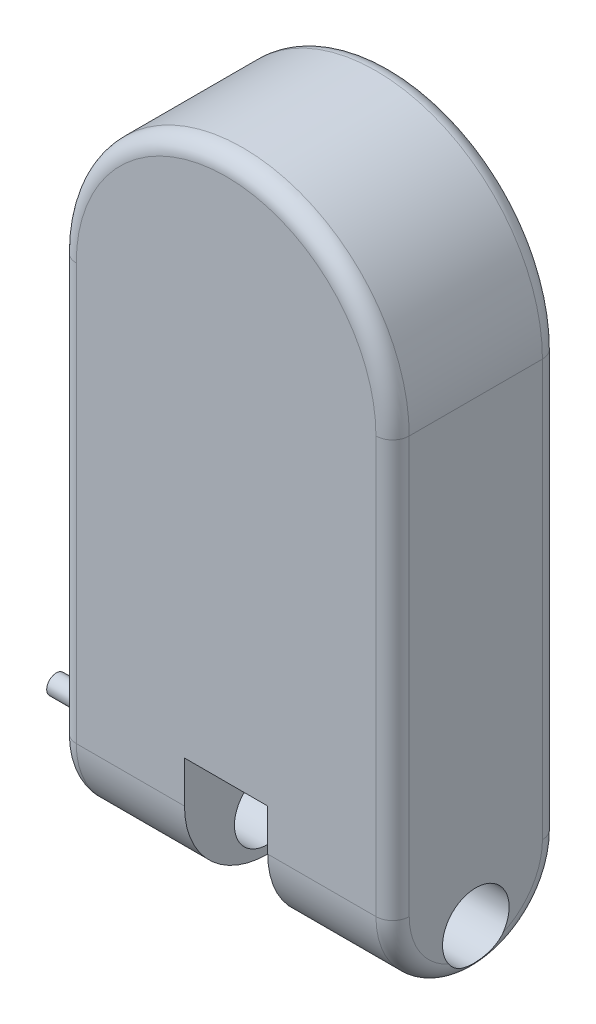
ISO-10303-21;
HEADER;
FILE_DESCRIPTION(('STEP AP214'),'2;1');
FILE_NAME('part.step','',(''),(''),'','','');
FILE_SCHEMA(('AUTOMOTIVE_DESIGN { 1 0 10303 214 1 1 1 1 }'));
ENDSEC;
DATA;
#1=APPLICATION_CONTEXT('core data for automotive mechanical design processes');
#2=APPLICATION_PROTOCOL_DEFINITION('international standard','automotive_design',2000,#1);
#3=PRODUCT_CONTEXT('',#1,'mechanical');
#4=PRODUCT('Part','Part','',(#3));
#5=PRODUCT_RELATED_PRODUCT_CATEGORY('part','',(#4));
#6=PRODUCT_DEFINITION_FORMATION('','',#4);
#7=PRODUCT_DEFINITION_CONTEXT('part definition',#1,'design');
#8=PRODUCT_DEFINITION('design','',#6,#7);
#9=PRODUCT_DEFINITION_SHAPE('','',#8);
#10=(LENGTH_UNIT() NAMED_UNIT(*) SI_UNIT(.MILLI.,.METRE.));
#11=(NAMED_UNIT(*) PLANE_ANGLE_UNIT() SI_UNIT($,.RADIAN.));
#12=(NAMED_UNIT(*) SI_UNIT($,.STERADIAN.) SOLID_ANGLE_UNIT());
#13=UNCERTAINTY_MEASURE_WITH_UNIT(LENGTH_MEASURE(1.E-05),#10,'distance_accuracy_value','');
#14=(GEOMETRIC_REPRESENTATION_CONTEXT(3) GLOBAL_UNCERTAINTY_ASSIGNED_CONTEXT((#13)) GLOBAL_UNIT_ASSIGNED_CONTEXT((#10,
#11,#12)) REPRESENTATION_CONTEXT('',''));
#15=CARTESIAN_POINT('',(0.,0.,0.));
#16=DIRECTION('',(0.,0.,1.));
#17=DIRECTION('',(1.,0.,0.));
#18=AXIS2_PLACEMENT_3D('',#15,#16,#17);
#19=CARTESIAN_POINT('',(-25.,-100.,-100.1));
#20=DIRECTION('',(0.,-1.,0.));
#21=DIRECTION('',(1.,0.,0.));
#22=AXIS2_PLACEMENT_3D('',#19,#20,#21);
#23=PLANE('',#22);
#24=DIRECTION('',(1.,0.,0.));
#25=VECTOR('',#24,1.);
#26=CARTESIAN_POINT('',(-25.,-100.,-100.));
#27=LINE('',#26,#25);
#28=CARTESIAN_POINT('',(-25.,-100.,-100.));
#29=VERTEX_POINT('',#28);
#30=CARTESIAN_POINT('',(25.,-100.,-100.));
#31=VERTEX_POINT('',#30);
#32=EDGE_CURVE('E96',#29,#31,#27,.T.);
#33=ORIENTED_EDGE('',*,*,#32,.T.);
#34=CARTESIAN_POINT('',(23.5893264020334,-100.,-90.1));
#35=DIRECTION('',(0.,-1.,0.));
#36=DIRECTION('',(1.,0.,0.));
#37=AXIS2_PLACEMENT_3D('',#34,#35,#36);
#38=CIRCLE('',#37,10.);
#39=CARTESIAN_POINT('',(23.5893264020334,-100.,-100.1));
#40=VERTEX_POINT('',#39);
#41=EDGE_CURVE('E12',#31,#40,#38,.F.);
#42=ORIENTED_EDGE('',*,*,#41,.T.);
#43=DIRECTION('',(1.,0.,0.));
#44=VECTOR('',#43,1.);
#45=CARTESIAN_POINT('',(-25.,-100.,-100.1));
#46=LINE('',#45,#44);
#47=CARTESIAN_POINT('',(-23.5893264020334,-100.,-100.1));
#48=VERTEX_POINT('',#47);
#49=EDGE_CURVE('E120',#48,#40,#46,.T.);
#50=ORIENTED_EDGE('',*,*,#49,.F.);
#51=CARTESIAN_POINT('',(-23.5893264020334,-100.,-90.1));
#52=DIRECTION('',(0.,-1.,0.));
#53=DIRECTION('',(1.,0.,0.));
#54=AXIS2_PLACEMENT_3D('',#51,#52,#53);
#55=CIRCLE('',#54,10.);
#56=EDGE_CURVE('E59',#48,#29,#55,.F.);
#57=ORIENTED_EDGE('',*,*,#56,.T.);
#58=EDGE_LOOP('',(#33,#42,#50,#57));
#59=FACE_BOUND('',#58,.T.);
#60=ADVANCED_FACE('F50',(#59),#23,.F.);
#61=CARTESIAN_POINT('',(0.,0.,-100.1));
#62=DIRECTION('',(0.,0.,-1.));
#63=DIRECTION('',(-1.,0.,0.));
#64=AXIS2_PLACEMENT_3D('',#61,#62,#63);
#65=PLANE('',#64);
#66=ORIENTED_EDGE('',*,*,#49,.T.);
#67=DIRECTION('',(0.,1.,0.));
#68=VECTOR('',#67,1.);
#69=CARTESIAN_POINT('',(23.5893264020334,-130.,-100.1));
#70=LINE('',#69,#68);
#71=CARTESIAN_POINT('',(23.5893264020334,-128.589326402033,-100.1));
#72=VERTEX_POINT('',#71);
#73=EDGE_CURVE('E108',#40,#72,#70,.F.);
#74=ORIENTED_EDGE('',*,*,#73,.T.);
#75=DIRECTION('',(1.,0.,0.));
#76=VECTOR('',#75,1.);
#77=CARTESIAN_POINT('',(-25.,-128.589326402033,-100.1));
#78=LINE('',#77,#76);
#79=CARTESIAN_POINT('',(-23.5893264020334,-128.589326402033,-100.1));
#80=VERTEX_POINT('',#79);
#81=EDGE_CURVE('E74',#72,#80,#78,.F.);
#82=ORIENTED_EDGE('',*,*,#81,.T.);
#83=DIRECTION('',(0.,-1.,0.));
#84=VECTOR('',#83,1.);
#85=CARTESIAN_POINT('',(-23.5893264020334,-100.,-100.1));
#86=LINE('',#85,#84);
#87=EDGE_CURVE('E111',#80,#48,#86,.F.);
#88=ORIENTED_EDGE('',*,*,#87,.T.);
#89=EDGE_LOOP('',(#66,#74,#82,#88));
#90=FACE_BOUND('',#89,.T.);
#91=ADVANCED_FACE('F124',(#90),#65,.T.);
#92=CARTESIAN_POINT('',(0.,0.,-100.));
#93=DIRECTION('',(0.,0.,-1.));
#94=DIRECTION('',(-1.,0.,0.));
#95=AXIS2_PLACEMENT_3D('',#92,#93,#94);
#96=PLANE('',#95);
#97=ORIENTED_EDGE('',*,*,#32,.F.);
#98=DIRECTION('',(0.,1.,0.));
#99=VECTOR('',#98,1.);
#100=CARTESIAN_POINT('',(-25.,-130.,-100.));
#101=LINE('',#100,#99);
#102=CARTESIAN_POINT('',(-25.,-130.,-100.));
#103=VERTEX_POINT('',#102);
#104=EDGE_CURVE('E119',#103,#29,#101,.T.);
#105=ORIENTED_EDGE('',*,*,#104,.F.);
#106=DIRECTION('',(-1.,0.,0.));
#107=VECTOR('',#106,1.);
#108=CARTESIAN_POINT('',(25.,-130.,-100.));
#109=LINE('',#108,#107);
#110=CARTESIAN_POINT('',(25.,-130.,-100.));
#111=VERTEX_POINT('',#110);
#112=EDGE_CURVE('E99',#111,#103,#109,.T.);
#113=ORIENTED_EDGE('',*,*,#112,.F.);
#114=DIRECTION('',(0.,-1.,0.));
#115=VECTOR('',#114,1.);
#116=CARTESIAN_POINT('',(25.,-100.,-100.));
#117=LINE('',#116,#115);
#118=EDGE_CURVE('E93',#31,#111,#117,.T.);
#119=ORIENTED_EDGE('',*,*,#118,.F.);
#120=EDGE_LOOP('',(#97,#105,#113,#119));
#121=FACE_BOUND('',#120,.T.);
#122=ADVANCED_FACE('F95',(#121),#96,.F.);
#123=CARTESIAN_POINT('',(-23.5893264020334,-130.,-90.1));
#124=DIRECTION('',(0.,1.,0.));
#125=DIRECTION('',(0.,0.,1.));
#126=AXIS2_PLACEMENT_3D('',#123,#124,#125);
#127=CYLINDRICAL_SURFACE('',#126,10.);
#128=ORIENTED_EDGE('',*,*,#56,.F.);
#129=ORIENTED_EDGE('',*,*,#87,.F.);
#130=CARTESIAN_POINT('',(-23.5893264020334,-128.589326402033,-90.1));
#131=DIRECTION('',(-0.707106781186547,0.707106781186547,0.));
#132=DIRECTION('',(0.707106781186547,0.707106781186547,0.));
#133=AXIS2_PLACEMENT_3D('',#130,#131,#132);
#134=ELLIPSE('',#133,14.1421356237309,10.);
#135=EDGE_CURVE('E54',#103,#80,#134,.F.);
#136=ORIENTED_EDGE('',*,*,#135,.F.);
#137=ORIENTED_EDGE('',*,*,#104,.T.);
#138=EDGE_LOOP('',(#128,#129,#136,#137));
#139=FACE_BOUND('',#138,.T.);
#140=ADVANCED_FACE('F52',(#139),#127,.T.);
#141=CARTESIAN_POINT('',(25.,-128.589326402033,-90.1));
#142=DIRECTION('',(-1.,0.,0.));
#143=DIRECTION('',(0.,0.,1.));
#144=AXIS2_PLACEMENT_3D('',#141,#142,#143);
#145=CYLINDRICAL_SURFACE('',#144,10.);
#146=ORIENTED_EDGE('',*,*,#135,.T.);
#147=ORIENTED_EDGE('',*,*,#81,.F.);
#148=CARTESIAN_POINT('',(23.5893264020334,-128.589326402033,-90.1));
#149=DIRECTION('',(-0.707106781186547,-0.707106781186548,0.));
#150=DIRECTION('',(-0.707106781186548,0.707106781186547,0.));
#151=AXIS2_PLACEMENT_3D('',#148,#149,#150);
#152=ELLIPSE('',#151,14.142135623731,10.);
#153=EDGE_CURVE('E67',#111,#72,#152,.F.);
#154=ORIENTED_EDGE('',*,*,#153,.F.);
#155=ORIENTED_EDGE('',*,*,#112,.T.);
#156=EDGE_LOOP('',(#146,#147,#154,#155));
#157=FACE_BOUND('',#156,.T.);
#158=ADVANCED_FACE('F117',(#157),#145,.T.);
#159=CARTESIAN_POINT('',(23.5893264020334,-100.,-90.1));
#160=DIRECTION('',(0.,-1.,0.));
#161=DIRECTION('',(1.,0.,0.));
#162=AXIS2_PLACEMENT_3D('',#159,#160,#161);
#163=CYLINDRICAL_SURFACE('',#162,10.);
#164=ORIENTED_EDGE('',*,*,#41,.F.);
#165=ORIENTED_EDGE('',*,*,#118,.T.);
#166=ORIENTED_EDGE('',*,*,#153,.T.);
#167=ORIENTED_EDGE('',*,*,#73,.F.);
#168=EDGE_LOOP('',(#164,#165,#166,#167));
#169=FACE_BOUND('',#168,.T.);
#170=ADVANCED_FACE('F107',(#169),#163,.T.);
#171=CLOSED_SHELL('',(#60,#91,#122,#140,#158,#170));
#172=MANIFOLD_SOLID_BREP('B2',#171);
#173=CARTESIAN_POINT('',(0.,-100.,-50.));
#174=DIRECTION('',(1.,0.,0.));
#175=DIRECTION('',(0.,0.,-1.));
#176=AXIS2_PLACEMENT_3D('',#173,#174,#175);
#177=CYLINDRICAL_SURFACE('',#176,50.);
#178=DIRECTION('',(1.,0.,0.));
#179=VECTOR('',#178,1.);
#180=CARTESIAN_POINT('',(0.,-100.,0.));
#181=LINE('',#180,#179);
#182=CARTESIAN_POINT('',(-90.,-100.,0.));
#183=VERTEX_POINT('',#182);
#184=CARTESIAN_POINT('',(-25.,-100.,0.));
#185=VERTEX_POINT('',#184);
#186=EDGE_CURVE('E373',#183,#185,#181,.T.);
#187=ORIENTED_EDGE('',*,*,#186,.F.);
#188=CARTESIAN_POINT('',(-90.,-100.,-50.));
#189=DIRECTION('',(-1.,0.,0.));
#190=DIRECTION('',(0.,-1.,0.));
#191=AXIS2_PLACEMENT_3D('',#188,#189,#190);
#192=CIRCLE('',#191,50.);
#193=CARTESIAN_POINT('',(-90.,-150.,-50.));
#194=VERTEX_POINT('',#193);
#195=EDGE_CURVE('E195',#183,#194,#192,.F.);
#196=ORIENTED_EDGE('',*,*,#195,.T.);
#197=DIRECTION('',(1.,0.,0.));
#198=VECTOR('',#197,1.);
#199=CARTESIAN_POINT('',(-100.,-150.,-50.));
#200=LINE('',#199,#198);
#201=CARTESIAN_POINT('',(-25.,-150.,-50.));
#202=VERTEX_POINT('',#201);
#203=EDGE_CURVE('E340',#202,#194,#200,.F.);
#204=ORIENTED_EDGE('',*,*,#203,.F.);
#205=CARTESIAN_POINT('',(-25.,-100.,-50.));
#206=DIRECTION('',(-1.,0.,0.));
#207=DIRECTION('',(0.,0.,1.));
#208=AXIS2_PLACEMENT_3D('',#205,#206,#207);
#209=CIRCLE('',#208,50.);
#210=EDGE_CURVE('E355',#185,#202,#209,.F.);
#211=ORIENTED_EDGE('',*,*,#210,.F.);
#212=EDGE_LOOP('',(#187,#196,#204,#211));
#213=FACE_BOUND('',#212,.T.);
#214=ADVANCED_FACE('F173',(#213),#177,.T.);
#215=CARTESIAN_POINT('',(-100.,-100.,-50.));
#216=DIRECTION('',(-1.,0.,0.));
#217=DIRECTION('',(0.,0.,1.));
#218=AXIS2_PLACEMENT_3D('',#215,#216,#217);
#219=CYLINDRICAL_SURFACE('',#218,50.);
#220=ORIENTED_EDGE('',*,*,#203,.T.);
#221=CARTESIAN_POINT('',(-90.,-100.,-50.));
#222=DIRECTION('',(-1.,0.,0.));
#223=DIRECTION('',(0.,-1.,0.));
#224=AXIS2_PLACEMENT_3D('',#221,#222,#223);
#225=CIRCLE('',#224,50.);
#226=CARTESIAN_POINT('',(-90.,-100.,-100.));
#227=VERTEX_POINT('',#226);
#228=EDGE_CURVE('E181',#194,#227,#225,.F.);
#229=ORIENTED_EDGE('',*,*,#228,.T.);
#230=DIRECTION('',(1.,0.,0.));
#231=VECTOR('',#230,1.);
#232=CARTESIAN_POINT('',(-100.,-100.,-100.));
#233=LINE('',#232,#231);
#234=CARTESIAN_POINT('',(-25.,-100.,-100.));
#235=VERTEX_POINT('',#234);
#236=EDGE_CURVE('E369',#235,#227,#233,.F.);
#237=ORIENTED_EDGE('',*,*,#236,.F.);
#238=CARTESIAN_POINT('',(-25.,-100.,-50.));
#239=DIRECTION('',(-1.,0.,0.));
#240=DIRECTION('',(0.,0.,1.));
#241=AXIS2_PLACEMENT_3D('',#238,#239,#240);
#242=CIRCLE('',#241,50.);
#243=EDGE_CURVE('E361',#202,#235,#242,.F.);
#244=ORIENTED_EDGE('',*,*,#243,.F.);
#245=EDGE_LOOP('',(#220,#229,#237,#244));
#246=FACE_BOUND('',#245,.T.);
#247=ADVANCED_FACE('F472',(#246),#219,.T.);
#248=CARTESIAN_POINT('',(100.,150.,-100.));
#249=DIRECTION('',(1.,0.,0.));
#250=DIRECTION('',(0.,1.,0.));
#251=AXIS2_PLACEMENT_3D('',#248,#249,#250);
#252=PLANE('',#251);
#253=CARTESIAN_POINT('',(100.,-100.,-50.));
#254=DIRECTION('',(1.,0.,0.));
#255=DIRECTION('',(0.,1.,0.));
#256=AXIS2_PLACEMENT_3D('',#253,#254,#255);
#257=CIRCLE('',#256,40.);
#258=CARTESIAN_POINT('',(100.,-136.5,-66.3630681719535));
#259=VERTEX_POINT('',#258);
#260=CARTESIAN_POINT('',(100.,-100.,-90.));
#261=VERTEX_POINT('',#260);
#262=EDGE_CURVE('E395',#259,#261,#257,.T.);
#263=ORIENTED_EDGE('',*,*,#262,.T.);
#264=DIRECTION('',(0.,1.,0.));
#265=VECTOR('',#264,1.);
#266=CARTESIAN_POINT('',(100.,150.,-90.));
#267=LINE('',#266,#265);
#268=CARTESIAN_POINT('',(100.,150.,-90.));
#269=VERTEX_POINT('',#268);
#270=EDGE_CURVE('E397',#261,#269,#267,.T.);
#271=ORIENTED_EDGE('',*,*,#270,.T.);
#272=DIRECTION('',(0.,0.,1.));
#273=VECTOR('',#272,1.);
#274=CARTESIAN_POINT('',(100.,150.,-100.));
#275=LINE('',#274,#273);
#276=CARTESIAN_POINT('',(100.,150.,-9.99999999999999));
#277=VERTEX_POINT('',#276);
#278=EDGE_CURVE('E351',#269,#277,#275,.T.);
#279=ORIENTED_EDGE('',*,*,#278,.T.);
#280=DIRECTION('',(0.,1.,0.));
#281=VECTOR('',#280,1.);
#282=CARTESIAN_POINT('',(100.,150.,-9.99999999999999));
#283=LINE('',#282,#281);
#284=CARTESIAN_POINT('',(100.,-100.,-10.));
#285=VERTEX_POINT('',#284);
#286=EDGE_CURVE('E391',#277,#285,#283,.F.);
#287=ORIENTED_EDGE('',*,*,#286,.T.);
#288=CARTESIAN_POINT('',(100.,-100.,-50.));
#289=DIRECTION('',(1.,0.,0.));
#290=DIRECTION('',(0.,1.,0.));
#291=AXIS2_PLACEMENT_3D('',#288,#289,#290);
#292=CIRCLE('',#291,40.);
#293=CARTESIAN_POINT('',(100.,-136.5,-33.6369318280465));
#294=VERTEX_POINT('',#293);
#295=EDGE_CURVE('E393',#285,#294,#292,.T.);
#296=ORIENTED_EDGE('',*,*,#295,.T.);
#297=CARTESIAN_POINT('',(100.,-125.,-50.));
#298=DIRECTION('',(-1.,0.,0.));
#299=DIRECTION('',(0.,-1.,0.));
#300=AXIS2_PLACEMENT_3D('',#297,#298,#299);
#301=CIRCLE('',#300,20.);
#302=EDGE_CURVE('E341',#294,#259,#301,.T.);
#303=ORIENTED_EDGE('',*,*,#302,.T.);
#304=EDGE_LOOP('',(#263,#271,#279,#287,#296,#303));
#305=FACE_BOUND('',#304,.T.);
#306=ADVANCED_FACE('F477',(#305),#252,.T.);
#307=CARTESIAN_POINT('',(-100.,150.,-100.));
#308=DIRECTION('',(-1.,0.,0.));
#309=DIRECTION('',(0.,-1.,0.));
#310=AXIS2_PLACEMENT_3D('',#307,#308,#309);
#311=PLANE('',#310);
#312=CARTESIAN_POINT('',(-100.,-95.,-20.));
#313=DIRECTION('',(-1.,0.,0.));
#314=DIRECTION('',(0.,-1.,0.));
#315=AXIS2_PLACEMENT_3D('',#312,#313,#314);
#316=CIRCLE('',#315,5.75000000000001);
#317=CARTESIAN_POINT('',(-100.,-100.75,-20.));
#318=VERTEX_POINT('',#317);
#319=EDGE_CURVE('E794',#318,#318,#316,.T.);
#320=ORIENTED_EDGE('',*,*,#319,.F.);
#321=EDGE_LOOP('',(#320));
#322=FACE_BOUND('',#321,.T.);
#323=CARTESIAN_POINT('',(-100.,-100.,-50.));
#324=DIRECTION('',(-1.,0.,0.));
#325=DIRECTION('',(0.,-1.,0.));
#326=AXIS2_PLACEMENT_3D('',#323,#324,#325);
#327=CIRCLE('',#326,40.);
#328=CARTESIAN_POINT('',(-100.,-136.5,-33.6369318280464));
#329=VERTEX_POINT('',#328);
#330=CARTESIAN_POINT('',(-100.,-100.,-10.));
#331=VERTEX_POINT('',#330);
#332=EDGE_CURVE('E545',#329,#331,#327,.T.);
#333=ORIENTED_EDGE('',*,*,#332,.T.);
#334=DIRECTION('',(0.,-1.,0.));
#335=VECTOR('',#334,1.);
#336=CARTESIAN_POINT('',(-100.,150.,-9.99999999999999));
#337=LINE('',#336,#335);
#338=CARTESIAN_POINT('',(-100.,150.,-9.99999999999999));
#339=VERTEX_POINT('',#338);
#340=EDGE_CURVE('E443',#331,#339,#337,.F.);
#341=ORIENTED_EDGE('',*,*,#340,.T.);
#342=DIRECTION('',(0.,0.,1.));
#343=VECTOR('',#342,1.);
#344=CARTESIAN_POINT('',(-100.,150.,-100.));
#345=LINE('',#344,#343);
#346=CARTESIAN_POINT('',(-100.,150.,-90.));
#347=VERTEX_POINT('',#346);
#348=EDGE_CURVE('E352',#347,#339,#345,.T.);
#349=ORIENTED_EDGE('',*,*,#348,.F.);
#350=DIRECTION('',(0.,-1.,0.));
#351=VECTOR('',#350,1.);
#352=CARTESIAN_POINT('',(-100.,-100.,-90.));
#353=LINE('',#352,#351);
#354=CARTESIAN_POINT('',(-100.,-100.,-90.));
#355=VERTEX_POINT('',#354);
#356=EDGE_CURVE('E539',#347,#355,#353,.T.);
#357=ORIENTED_EDGE('',*,*,#356,.T.);
#358=CARTESIAN_POINT('',(-100.,-100.,-50.));
#359=DIRECTION('',(-1.,0.,0.));
#360=DIRECTION('',(0.,-1.,0.));
#361=AXIS2_PLACEMENT_3D('',#358,#359,#360);
#362=CIRCLE('',#361,40.);
#363=CARTESIAN_POINT('',(-100.,-136.5,-66.3630681719536));
#364=VERTEX_POINT('',#363);
#365=EDGE_CURVE('E544',#355,#364,#362,.T.);
#366=ORIENTED_EDGE('',*,*,#365,.T.);
#367=CARTESIAN_POINT('',(-100.,-125.,-50.));
#368=DIRECTION('',(-1.,0.,0.));
#369=DIRECTION('',(0.,-1.,0.));
#370=AXIS2_PLACEMENT_3D('',#367,#368,#369);
#371=CIRCLE('',#370,20.);
#372=EDGE_CURVE('E345',#329,#364,#371,.T.);
#373=ORIENTED_EDGE('',*,*,#372,.F.);
#374=EDGE_LOOP('',(#333,#341,#349,#357,#366,#373));
#375=FACE_BOUND('',#374,.T.);
#376=ADVANCED_FACE('F550',(#322,#375),#311,.T.);
#377=CARTESIAN_POINT('',(0.,0.,-100.));
#378=DIRECTION('',(0.,0.,1.));
#379=DIRECTION('',(1.,0.,0.));
#380=AXIS2_PLACEMENT_3D('',#377,#378,#379);
#381=PLANE('',#380);
#382=CARTESIAN_POINT('',(0.,150.,-100.));
#383=DIRECTION('',(0.,0.,1.));
#384=DIRECTION('',(1.,0.,0.));
#385=AXIS2_PLACEMENT_3D('',#382,#383,#384);
#386=CIRCLE('',#385,90.);
#387=CARTESIAN_POINT('',(-90.,150.,-100.));
#388=VERTEX_POINT('',#387);
#389=CARTESIAN_POINT('',(90.,150.,-100.));
#390=VERTEX_POINT('',#389);
#391=EDGE_CURVE('E386',#388,#390,#386,.F.);
#392=ORIENTED_EDGE('',*,*,#391,.T.);
#393=DIRECTION('',(0.,1.,0.));
#394=VECTOR('',#393,1.);
#395=CARTESIAN_POINT('',(90.,-100.,-100.));
#396=LINE('',#395,#394);
#397=CARTESIAN_POINT('',(90.,-100.,-100.));
#398=VERTEX_POINT('',#397);
#399=EDGE_CURVE('E389',#390,#398,#396,.F.);
#400=ORIENTED_EDGE('',*,*,#399,.T.);
#401=CARTESIAN_POINT('',(25.,-100.,-100.));
#402=VERTEX_POINT('',#401);
#403=EDGE_CURVE('E374',#398,#402,#233,.F.);
#404=ORIENTED_EDGE('',*,*,#403,.T.);
#405=DIRECTION('',(-1.,0.,0.));
#406=VECTOR('',#405,1.);
#407=CARTESIAN_POINT('',(-25.,-100.,-100.));
#408=LINE('',#407,#406);
#409=EDGE_CURVE('E334',#402,#235,#408,.T.);
#410=ORIENTED_EDGE('',*,*,#409,.T.);
#411=ORIENTED_EDGE('',*,*,#236,.T.);
#412=DIRECTION('',(0.,-1.,0.));
#413=VECTOR('',#412,1.);
#414=CARTESIAN_POINT('',(-90.,150.,-100.));
#415=LINE('',#414,#413);
#416=EDGE_CURVE('E384',#227,#388,#415,.F.);
#417=ORIENTED_EDGE('',*,*,#416,.T.);
#418=EDGE_LOOP('',(#392,#400,#404,#410,#411,#417));
#419=FACE_BOUND('',#418,.T.);
#420=ADVANCED_FACE('F589',(#419),#381,.F.);
#421=CARTESIAN_POINT('',(0.,0.,0.));
#422=DIRECTION('',(0.,0.,1.));
#423=DIRECTION('',(1.,0.,0.));
#424=AXIS2_PLACEMENT_3D('',#421,#422,#423);
#425=PLANE('',#424);
#426=DIRECTION('',(0.,-1.,0.));
#427=VECTOR('',#426,1.);
#428=CARTESIAN_POINT('',(-25.,-100.,0.));
#429=LINE('',#428,#427);
#430=CARTESIAN_POINT('',(-25.,-75.,0.));
#431=VERTEX_POINT('',#430);
#432=EDGE_CURVE('E317',#431,#185,#429,.T.);
#433=ORIENTED_EDGE('',*,*,#432,.F.);
#434=DIRECTION('',(-1.,0.,0.));
#435=VECTOR('',#434,1.);
#436=CARTESIAN_POINT('',(-25.,-75.,0.));
#437=LINE('',#436,#435);
#438=CARTESIAN_POINT('',(25.,-75.,0.));
#439=VERTEX_POINT('',#438);
#440=EDGE_CURVE('E325',#439,#431,#437,.T.);
#441=ORIENTED_EDGE('',*,*,#440,.F.);
#442=DIRECTION('',(0.,1.,0.));
#443=VECTOR('',#442,1.);
#444=CARTESIAN_POINT('',(25.,-75.,0.));
#445=LINE('',#444,#443);
#446=CARTESIAN_POINT('',(25.,-100.,0.));
#447=VERTEX_POINT('',#446);
#448=EDGE_CURVE('E308',#447,#439,#445,.T.);
#449=ORIENTED_EDGE('',*,*,#448,.F.);
#450=CARTESIAN_POINT('',(90.,-100.,0.));
#451=VERTEX_POINT('',#450);
#452=EDGE_CURVE('E376',#447,#451,#181,.T.);
#453=ORIENTED_EDGE('',*,*,#452,.T.);
#454=DIRECTION('',(0.,1.,0.));
#455=VECTOR('',#454,1.);
#456=CARTESIAN_POINT('',(90.,0.,0.));
#457=LINE('',#456,#455);
#458=CARTESIAN_POINT('',(90.,150.,0.));
#459=VERTEX_POINT('',#458);
#460=EDGE_CURVE('E530',#451,#459,#457,.T.);
#461=ORIENTED_EDGE('',*,*,#460,.T.);
#462=CARTESIAN_POINT('',(0.,150.,0.));
#463=DIRECTION('',(0.,0.,1.));
#464=DIRECTION('',(1.,0.,0.));
#465=AXIS2_PLACEMENT_3D('',#462,#463,#464);
#466=CIRCLE('',#465,90.);
#467=CARTESIAN_POINT('',(-90.,150.,0.));
#468=VERTEX_POINT('',#467);
#469=EDGE_CURVE('E535',#459,#468,#466,.T.);
#470=ORIENTED_EDGE('',*,*,#469,.T.);
#471=DIRECTION('',(0.,-1.,0.));
#472=VECTOR('',#471,1.);
#473=CARTESIAN_POINT('',(-90.,0.,0.));
#474=LINE('',#473,#472);
#475=EDGE_CURVE('E504',#468,#183,#474,.T.);
#476=ORIENTED_EDGE('',*,*,#475,.T.);
#477=ORIENTED_EDGE('',*,*,#186,.T.);
#478=EDGE_LOOP('',(#433,#441,#449,#453,#461,#470,#476,#477));
#479=FACE_BOUND('',#478,.T.);
#480=ADVANCED_FACE('F599',(#479),#425,.T.);
#481=CARTESIAN_POINT('',(25.,-175.,-100.));
#482=DIRECTION('',(1.,0.,0.));
#483=DIRECTION('',(0.,0.,-1.));
#484=AXIS2_PLACEMENT_3D('',#481,#482,#483);
#485=PLANE('',#484);
#486=CARTESIAN_POINT('',(25.,-100.,-50.));
#487=DIRECTION('',(1.,0.,0.));
#488=DIRECTION('',(0.,0.,-1.));
#489=AXIS2_PLACEMENT_3D('',#486,#487,#488);
#490=CIRCLE('',#489,50.);
#491=CARTESIAN_POINT('',(25.,-150.,-50.));
#492=VERTEX_POINT('',#491);
#493=EDGE_CURVE('E364',#492,#447,#490,.F.);
#494=ORIENTED_EDGE('',*,*,#493,.T.);
#495=ORIENTED_EDGE('',*,*,#448,.T.);
#496=DIRECTION('',(0.,0.,1.));
#497=VECTOR('',#496,1.);
#498=CARTESIAN_POINT('',(25.,-75.,-99.));
#499=LINE('',#498,#497);
#500=CARTESIAN_POINT('',(25.,-75.,-99.));
#501=VERTEX_POINT('',#500);
#502=EDGE_CURVE('E300',#501,#439,#499,.T.);
#503=ORIENTED_EDGE('',*,*,#502,.F.);
#504=DIRECTION('',(0.,1.,0.));
#505=VECTOR('',#504,1.);
#506=CARTESIAN_POINT('',(25.,-75.,-99.));
#507=LINE('',#506,#505);
#508=CARTESIAN_POINT('',(25.,-99.4302970896538,-99.));
#509=VERTEX_POINT('',#508);
#510=EDGE_CURVE('E306',#509,#501,#507,.T.);
#511=ORIENTED_EDGE('',*,*,#510,.F.);
#512=CARTESIAN_POINT('',(25.,-186.602540378444,-50.));
#513=DIRECTION('',(1.,0.,0.));
#514=DIRECTION('',(0.,0.,-1.));
#515=AXIS2_PLACEMENT_3D('',#512,#513,#514);
#516=CIRCLE('',#515,100.);
#517=EDGE_CURVE('E335',#402,#509,#516,.T.);
#518=ORIENTED_EDGE('',*,*,#517,.F.);
#519=CARTESIAN_POINT('',(25.,-100.,-50.));
#520=DIRECTION('',(1.,0.,0.));
#521=DIRECTION('',(0.,0.,-1.));
#522=AXIS2_PLACEMENT_3D('',#519,#520,#521);
#523=CIRCLE('',#522,50.);
#524=EDGE_CURVE('E366',#402,#492,#523,.F.);
#525=ORIENTED_EDGE('',*,*,#524,.T.);
#526=EDGE_LOOP('',(#494,#495,#503,#511,#518,#525));
#527=FACE_BOUND('',#526,.T.);
#528=CARTESIAN_POINT('',(25.,-125.,-50.));
#529=DIRECTION('',(1.,0.,0.));
#530=DIRECTION('',(0.,0.,-1.));
#531=AXIS2_PLACEMENT_3D('',#528,#529,#530);
#532=CIRCLE('',#531,20.);
#533=CARTESIAN_POINT('',(25.,-125.,-70.));
#534=VERTEX_POINT('',#533);
#535=EDGE_CURVE('E348',#534,#534,#532,.T.);
#536=ORIENTED_EDGE('',*,*,#535,.T.);
#537=EDGE_LOOP('',(#536));
#538=FACE_BOUND('',#537,.T.);
#539=ADVANCED_FACE('F303',(#527,#538),#485,.F.);
#540=CARTESIAN_POINT('',(-25.,-175.,-100.));
#541=DIRECTION('',(-1.,0.,0.));
#542=DIRECTION('',(0.,0.,1.));
#543=AXIS2_PLACEMENT_3D('',#540,#541,#542);
#544=PLANE('',#543);
#545=ORIENTED_EDGE('',*,*,#432,.T.);
#546=ORIENTED_EDGE('',*,*,#210,.T.);
#547=ORIENTED_EDGE('',*,*,#243,.T.);
#548=CARTESIAN_POINT('',(-25.,-186.602540378444,-50.));
#549=DIRECTION('',(1.,0.,0.));
#550=DIRECTION('',(0.,0.,-1.));
#551=AXIS2_PLACEMENT_3D('',#548,#549,#550);
#552=CIRCLE('',#551,100.);
#553=CARTESIAN_POINT('',(-25.,-99.4302970896538,-99.));
#554=VERTEX_POINT('',#553);
#555=EDGE_CURVE('E331',#235,#554,#552,.T.);
#556=ORIENTED_EDGE('',*,*,#555,.T.);
#557=DIRECTION('',(0.,-1.,0.));
#558=VECTOR('',#557,1.);
#559=CARTESIAN_POINT('',(-25.,-100.,-99.));
#560=LINE('',#559,#558);
#561=CARTESIAN_POINT('',(-25.,-75.,-99.));
#562=VERTEX_POINT('',#561);
#563=EDGE_CURVE('E188',#562,#554,#560,.T.);
#564=ORIENTED_EDGE('',*,*,#563,.F.);
#565=DIRECTION('',(0.,0.,1.));
#566=VECTOR('',#565,1.);
#567=CARTESIAN_POINT('',(-25.,-75.,-99.));
#568=LINE('',#567,#566);
#569=EDGE_CURVE('E313',#562,#431,#568,.T.);
#570=ORIENTED_EDGE('',*,*,#569,.T.);
#571=EDGE_LOOP('',(#545,#546,#547,#556,#564,#570));
#572=FACE_BOUND('',#571,.T.);
#573=CARTESIAN_POINT('',(-25.,-125.,-50.));
#574=DIRECTION('',(-1.,0.,0.));
#575=DIRECTION('',(0.,0.,1.));
#576=AXIS2_PLACEMENT_3D('',#573,#574,#575);
#577=CIRCLE('',#576,20.);
#578=CARTESIAN_POINT('',(-25.,-125.,-30.));
#579=VERTEX_POINT('',#578);
#580=EDGE_CURVE('E344',#579,#579,#577,.T.);
#581=ORIENTED_EDGE('',*,*,#580,.T.);
#582=EDGE_LOOP('',(#581));
#583=FACE_BOUND('',#582,.T.);
#584=ADVANCED_FACE('F428',(#572,#583),#544,.F.);
#585=CARTESIAN_POINT('',(100.,-125.,-50.));
#586=DIRECTION('',(-1.,0.,0.));
#587=DIRECTION('',(0.,-1.,0.));
#588=AXIS2_PLACEMENT_3D('',#585,#586,#587);
#589=CYLINDRICAL_SURFACE('',#588,20.);
#590=CARTESIAN_POINT('',(-100.,-136.5,-66.3630681719536));
#591=CARTESIAN_POINT('',(-99.9999944988369,-136.717635786294,-66.2101150233157));
#592=CARTESIAN_POINT('',(-99.9972251505422,-136.932182024762,-66.0528421805291));
#593=CARTESIAN_POINT('',(-99.9867556613727,-137.35473388776,-65.729947430497));
#594=CARTESIAN_POINT('',(-99.9790561221654,-137.562740307143,-65.5643265442968));
#595=CARTESIAN_POINT('',(-99.9494718778201,-138.176161814739,-65.0555886797701));
#596=CARTESIAN_POINT('',(-99.9210996400918,-138.571325329766,-64.7003530754295));
#597=CARTESIAN_POINT('',(-99.8515096756831,-139.330811895632,-63.9609577577295));
#598=CARTESIAN_POINT('',(-99.8103152955771,-139.695189480587,-63.5768515684689));
#599=CARTESIAN_POINT('',(-99.7190573029856,-140.391950208584,-62.7815251896323));
#600=CARTESIAN_POINT('',(-99.6689923089183,-140.724328355308,-62.3703007827167));
#601=CARTESIAN_POINT('',(-99.5631593930954,-141.358618976357,-61.5187034560061));
#602=CARTESIAN_POINT('',(-99.5073357106278,-141.660163582177,-61.0780636594513));
#603=CARTESIAN_POINT('',(-99.3940622995594,-142.226993438192,-60.1742441935076));
#604=CARTESIAN_POINT('',(-99.3366125479803,-142.492278175682,-59.7110642055318));
#605=CARTESIAN_POINT('',(-99.2235017558159,-142.985054029716,-58.7648363026766));
#606=CARTESIAN_POINT('',(-99.167840615512,-143.212547256171,-58.2817894988467));
#607=CARTESIAN_POINT('',(-99.0614849028067,-143.628363325728,-57.2985605452276));
#608=CARTESIAN_POINT('',(-99.0107905215469,-143.816684661646,-56.7983777369726));
#609=CARTESIAN_POINT('',(-98.914628020795,-144.162335252227,-55.7553050669511));
#610=CARTESIAN_POINT('',(-98.8696146444547,-144.31732359583,-55.2115959974651));
#611=CARTESIAN_POINT('',(-98.7912772213222,-144.580856141992,-54.1121164115952));
#612=CARTESIAN_POINT('',(-98.7579530630838,-144.689400787352,-53.556346010259));
#613=CARTESIAN_POINT('',(-98.7183397843355,-144.816752364834,-52.7160701639445));
#614=CARTESIAN_POINT('',(-98.7068534918599,-144.853323941299,-52.4343883277259));
#615=CARTESIAN_POINT('',(-98.6875556329067,-144.914450380322,-51.8695779250219));
#616=CARTESIAN_POINT('',(-98.6797440577708,-144.939005271195,-51.5864493619469));
#617=CARTESIAN_POINT('',(-98.6679366207012,-144.976034163262,-51.0192418997107));
#618=CARTESIAN_POINT('',(-98.6639419207102,-144.988504485659,-50.7351627375596));
#619=CARTESIAN_POINT('',(-98.6598264732936,-145.001327339773,-50.1666967726028));
#620=CARTESIAN_POINT('',(-98.6597058137055,-145.001679596733,-49.8823099629679));
#621=CARTESIAN_POINT('',(-98.6615493262836,-144.995960582491,-49.5980542531013));
#622=B_SPLINE_CURVE_WITH_KNOTS('',3,(#590,#591,#592,#593,#594,#595,#596,#597,#598,#599,#600,
#601,#602,#603,#604,#605,#606,#607,#608,#609,#610,#611,#612,#613,#614,#615,#616,#617,#618,#619,
#620,#621),.UNSPECIFIED.,.F.,.F.,(4,2,2,2,2,2,2,2,2,2,2,2,2,2,2,4),(0.,0.797874642750557,
1.59565193352407,3.1899412608992,4.78134451960049,6.37299585463967,7.9818400114366,
9.59070691451072,11.1994839638915,12.8083229014096,14.5077128583875,16.2070866127463,
17.0596892460926,17.91228987052,18.7651499631725,19.6180293930039),.UNSPECIFIED.);
#623=CARTESIAN_POINT('',(-98.6602540378444,-145.,-50.));
#624=VERTEX_POINT('',#623);
#625=EDGE_CURVE('E435',#364,#624,#622,.T.);
#626=ORIENTED_EDGE('',*,*,#625,.T.);
#627=CARTESIAN_POINT('',(-98.6602540378444,-145.,-50.));
#628=CARTESIAN_POINT('',(-98.660247528865,-145.000000557423,-49.7291162562174));
#629=CARTESIAN_POINT('',(-98.6620203059655,-144.994495715576,-49.4582663052626));
#630=CARTESIAN_POINT('',(-98.6690632302412,-144.972496289671,-48.9170644816353));
#631=CARTESIAN_POINT('',(-98.6743333002116,-144.956001948214,-48.6467125980998));
#632=CARTESIAN_POINT('',(-98.6952902819852,-144.8900894424,-47.8373209986366));
#633=CARTESIAN_POINT('',(-98.7161240917141,-144.824241746037,-47.2996541799823));
#634=CARTESIAN_POINT('',(-98.7701739357349,-144.649543192614,-46.2334838396406));
#635=CARTESIAN_POINT('',(-98.8033583037589,-144.540802269524,-45.7049604702912));
#636=CARTESIAN_POINT('',(-98.8801161670473,-144.281208901752,-44.6590938773701));
#637=CARTESIAN_POINT('',(-98.9236903013259,-144.130353866779,-44.1417513436021));
#638=CARTESIAN_POINT('',(-99.0189152913429,-143.786789461718,-43.1189296044383));
#639=CARTESIAN_POINT('',(-99.0706068716683,-143.593867036125,-42.6135258599768));
#640=CARTESIAN_POINT('',(-99.1788835403941,-143.16796707267,-41.6204488654864));
#641=CARTESIAN_POINT('',(-99.2354685830894,-142.934989908899,-41.1327754499163));
#642=CARTESIAN_POINT('',(-99.3502215235499,-142.430402873405,-40.1779497284365));
#643=CARTESIAN_POINT('',(-99.4083896442132,-142.158787538414,-39.7108003367798));
#644=CARTESIAN_POINT('',(-99.5227473765823,-141.578517537487,-38.7998012021265));
#645=CARTESIAN_POINT('',(-99.5789368427548,-141.269860154377,-38.3559531718098));
#646=CARTESIAN_POINT('',(-99.6878982994192,-140.602912464245,-37.4753289636808));
#647=CARTESIAN_POINT('',(-99.740412180585,-140.243038677624,-37.0397174887075));
#648=CARTESIAN_POINT('',(-99.8345685865417,-139.487138492257,-36.1999281519389));
#649=CARTESIAN_POINT('',(-99.8762127470128,-139.09111754507,-35.7957455671454));
#650=CARTESIAN_POINT('',(-99.9437724111679,-138.26432007541,-35.0206968408248));
#651=CARTESIAN_POINT('',(-99.969646571122,-137.833455521703,-34.6499204268788));
#652=CARTESIAN_POINT('',(-99.992406932906,-137.164262783443,-34.1219764911394));
#653=CARTESIAN_POINT('',(-99.997317042392,-136.937265917523,-33.9506217314705));
#654=CARTESIAN_POINT('',(-100.001019493978,-136.47611190923,-33.6177002554482));
#655=CARTESIAN_POINT('',(-99.9998109947271,-136.241953786537,-33.4561348882949));
#656=CARTESIAN_POINT('',(-99.9951651075579,-136.004453188326,-33.299640422256));
#657=B_SPLINE_CURVE_WITH_KNOTS('',3,(#627,#628,#629,#630,#631,#632,#633,#634,#635,#636,#637,
#638,#639,#640,#641,#642,#643,#644,#645,#646,#647,#648,#649,#650,#651,#652,#653,#654,#655,#656),
.UNSPECIFIED.,.F.,.F.,(4,2,2,2,2,2,2,2,2,2,2,2,2,2,4),(0.,0.812522437824897,1.62502693931456,
3.24916534614429,4.8691679062604,6.48927012904759,8.1177764581638,9.74626757863838,
11.3749891898565,13.0038303470725,14.704137296452,16.404188235224,18.1086771866606,
18.9617565600298,19.8149532408673),.UNSPECIFIED.);
#658=EDGE_CURVE('E442',#624,#329,#657,.T.);
#659=ORIENTED_EDGE('',*,*,#658,.T.);
#660=ORIENTED_EDGE('',*,*,#372,.T.);
#661=EDGE_LOOP('',(#626,#659,#660));
#662=FACE_BOUND('',#661,.T.);
#663=ORIENTED_EDGE('',*,*,#580,.F.);
#664=EDGE_LOOP('',(#663));
#665=FACE_BOUND('',#664,.T.);
#666=ADVANCED_FACE('F424',(#662,#665),#589,.F.);
#667=CARTESIAN_POINT('',(100.,-136.5,-33.6369318280465));
#668=CARTESIAN_POINT('',(99.9999944988369,-136.717635786294,-33.7898849766843));
#669=CARTESIAN_POINT('',(99.9972251505423,-136.932182024762,-33.9471578194709));
#670=CARTESIAN_POINT('',(99.9867556613727,-137.35473388776,-34.270052569503));
#671=CARTESIAN_POINT('',(99.9790561221654,-137.562740307143,-34.4356734557032));
#672=CARTESIAN_POINT('',(99.9494718778202,-138.176161814739,-34.9444113202299));
#673=CARTESIAN_POINT('',(99.9210996400919,-138.571325329766,-35.2996469245705));
#674=CARTESIAN_POINT('',(99.8515096756831,-139.330811895632,-36.0390422422705));
#675=CARTESIAN_POINT('',(99.8103152955772,-139.695189480587,-36.4231484315311));
#676=CARTESIAN_POINT('',(99.7190573029856,-140.391950208584,-37.2184748103677));
#677=CARTESIAN_POINT('',(99.6689923089184,-140.724328355308,-37.6296992172834));
#678=CARTESIAN_POINT('',(99.5631593930955,-141.358618976357,-38.481296543994));
#679=CARTESIAN_POINT('',(99.5073357106278,-141.660163582177,-38.9219363405488));
#680=CARTESIAN_POINT('',(99.3940622995595,-142.226993438192,-39.8257558064925));
#681=CARTESIAN_POINT('',(99.3366125479804,-142.492278175682,-40.2889357944682));
#682=CARTESIAN_POINT('',(99.223501755816,-142.985054029716,-41.2351636973234));
#683=CARTESIAN_POINT('',(99.1678406155121,-143.212547256171,-41.7182105011533));
#684=CARTESIAN_POINT('',(99.0614849028068,-143.628363325728,-42.7014394547724));
#685=CARTESIAN_POINT('',(99.010790521547,-143.816684661646,-43.2016222630274));
#686=CARTESIAN_POINT('',(98.914628020795,-144.162335252227,-44.2446949330489));
#687=CARTESIAN_POINT('',(98.8696146444547,-144.31732359583,-44.7884040025349));
#688=CARTESIAN_POINT('',(98.7912772213223,-144.580856141992,-45.8878835884048));
#689=CARTESIAN_POINT('',(98.7579530630839,-144.689400787352,-46.443653989741));
#690=CARTESIAN_POINT('',(98.7183397843356,-144.816752364834,-47.2839298360555));
#691=CARTESIAN_POINT('',(98.7068534918599,-144.853323941299,-47.5656116722741));
#692=CARTESIAN_POINT('',(98.6875556329068,-144.914450380322,-48.1304220749781));
#693=CARTESIAN_POINT('',(98.6797440577709,-144.939005271195,-48.4135506380531));
#694=CARTESIAN_POINT('',(98.6679366207012,-144.976034163262,-48.9807581002893));
#695=CARTESIAN_POINT('',(98.6639419207103,-144.988504485659,-49.2648372624404));
#696=CARTESIAN_POINT('',(98.6598264732937,-145.001327339773,-49.8333032273972));
#697=CARTESIAN_POINT('',(98.6597058137055,-145.001679596733,-50.1176900370321));
#698=CARTESIAN_POINT('',(98.6615493262836,-144.995960582491,-50.4019457468987));
#699=B_SPLINE_CURVE_WITH_KNOTS('',3,(#667,#668,#669,#670,#671,#672,#673,#674,#675,#676,#677,
#678,#679,#680,#681,#682,#683,#684,#685,#686,#687,#688,#689,#690,#691,#692,#693,#694,#695,#696,
#697,#698),.UNSPECIFIED.,.F.,.F.,(4,2,2,2,2,2,2,2,2,2,2,2,2,2,2,4),(0.,0.797874642750553,
1.59565193352409,3.1899412608992,4.78134451960052,6.37299585463969,7.98184001143664,
9.59070691451072,11.1994839638915,12.8083229014095,14.5077128583875,16.2070866127463,
17.0596892460926,17.91228987052,18.7651499631725,19.6180293930039),.UNSPECIFIED.);
#700=CARTESIAN_POINT('',(98.6602540378445,-145.,-50.));
#701=VERTEX_POINT('',#700);
#702=EDGE_CURVE('E399',#294,#701,#699,.T.);
#703=ORIENTED_EDGE('',*,*,#702,.T.);
#704=CARTESIAN_POINT('',(98.6602540378444,-145.,-50.));
#705=CARTESIAN_POINT('',(98.6602475288651,-145.000000557423,-50.2708837437826));
#706=CARTESIAN_POINT('',(98.6620203059656,-144.994495715576,-50.5417336947374));
#707=CARTESIAN_POINT('',(98.6690632302413,-144.972496289671,-51.0829355183647));
#708=CARTESIAN_POINT('',(98.6743333002116,-144.956001948214,-51.3532874019002));
#709=CARTESIAN_POINT('',(98.6952902819853,-144.8900894424,-52.1626790013634));
#710=CARTESIAN_POINT('',(98.7161240917141,-144.824241746037,-52.7003458200177));
#711=CARTESIAN_POINT('',(98.7701739357349,-144.649543192614,-53.7665161603594));
#712=CARTESIAN_POINT('',(98.8033583037589,-144.540802269524,-54.2950395297088));
#713=CARTESIAN_POINT('',(98.8801161670473,-144.281208901752,-55.3409061226299));
#714=CARTESIAN_POINT('',(98.923690301326,-144.130353866779,-55.858248656398));
#715=CARTESIAN_POINT('',(99.0189152913429,-143.786789461718,-56.8810703955617));
#716=CARTESIAN_POINT('',(99.0706068716684,-143.593867036125,-57.3864741400232));
#717=CARTESIAN_POINT('',(99.1788835403941,-143.16796707267,-58.3795511345136));
#718=CARTESIAN_POINT('',(99.2354685830894,-142.934989908899,-58.8672245500837));
#719=CARTESIAN_POINT('',(99.35022152355,-142.430402873405,-59.8220502715635));
#720=CARTESIAN_POINT('',(99.4083896442133,-142.158787538414,-60.2891996632202));
#721=CARTESIAN_POINT('',(99.5227473765824,-141.578517537487,-61.2001987978735));
#722=CARTESIAN_POINT('',(99.5789368427548,-141.269860154377,-61.6440468281902));
#723=CARTESIAN_POINT('',(99.6878982994192,-140.602912464245,-62.5246710363192));
#724=CARTESIAN_POINT('',(99.740412180585,-140.243038677624,-62.9602825112925));
#725=CARTESIAN_POINT('',(99.8345685865418,-139.487138492257,-63.8000718480611));
#726=CARTESIAN_POINT('',(99.8762127470129,-139.09111754507,-64.2042544328546));
#727=CARTESIAN_POINT('',(99.943772411168,-138.26432007541,-64.9793031591752));
#728=CARTESIAN_POINT('',(99.969646571122,-137.833455521703,-65.3500795731212));
#729=CARTESIAN_POINT('',(99.992406932906,-137.164262783443,-65.8780235088606));
#730=CARTESIAN_POINT('',(99.9973170423921,-136.937265917523,-66.0493782685295));
#731=CARTESIAN_POINT('',(100.001019493978,-136.47611190923,-66.3822997445518));
#732=CARTESIAN_POINT('',(99.9998109947272,-136.241953786537,-66.5438651117052));
#733=CARTESIAN_POINT('',(99.995165107558,-136.004453188326,-66.700359577744));
#734=B_SPLINE_CURVE_WITH_KNOTS('',3,(#704,#705,#706,#707,#708,#709,#710,#711,#712,#713,#714,
#715,#716,#717,#718,#719,#720,#721,#722,#723,#724,#725,#726,#727,#728,#729,#730,#731,#732,#733),
.UNSPECIFIED.,.F.,.F.,(4,2,2,2,2,2,2,2,2,2,2,2,2,2,4),(0.,0.812522437824897,1.62502693931456,
3.2491653461443,4.86916790626038,6.4892701290476,8.1177764581638,9.74626757863837,
11.3749891898565,13.0038303470725,14.704137296452,16.404188235224,18.1086771866605,
18.9617565600298,19.8149532408673),.UNSPECIFIED.);
#735=EDGE_CURVE('E407',#701,#259,#734,.T.);
#736=ORIENTED_EDGE('',*,*,#735,.T.);
#737=ORIENTED_EDGE('',*,*,#302,.F.);
#738=EDGE_LOOP('',(#703,#736,#737));
#739=FACE_BOUND('',#738,.T.);
#740=ORIENTED_EDGE('',*,*,#535,.F.);
#741=EDGE_LOOP('',(#740));
#742=FACE_BOUND('',#741,.T.);
#743=ADVANCED_FACE('F418',(#739,#742),#589,.F.);
#744=DIRECTION('',(1.,0.,0.));
#745=VECTOR('',#744,1.);
#746=CARTESIAN_POINT('',(62.5,-150.,-50.));
#747=LINE('',#746,#745);
#748=CARTESIAN_POINT('',(90.,-150.,-50.));
#749=VERTEX_POINT('',#748);
#750=EDGE_CURVE('E370',#749,#492,#747,.F.);
#751=ORIENTED_EDGE('',*,*,#750,.F.);
#752=CARTESIAN_POINT('',(90.,-100.,-50.));
#753=DIRECTION('',(1.,0.,0.));
#754=DIRECTION('',(0.,1.,0.));
#755=AXIS2_PLACEMENT_3D('',#752,#753,#754);
#756=CIRCLE('',#755,50.);
#757=EDGE_CURVE('E492',#749,#451,#756,.F.);
#758=ORIENTED_EDGE('',*,*,#757,.T.);
#759=ORIENTED_EDGE('',*,*,#452,.F.);
#760=ORIENTED_EDGE('',*,*,#493,.F.);
#761=EDGE_LOOP('',(#751,#758,#759,#760));
#762=FACE_BOUND('',#761,.T.);
#763=ADVANCED_FACE('F423',(#762),#177,.T.);
#764=ORIENTED_EDGE('',*,*,#403,.F.);
#765=CARTESIAN_POINT('',(90.,-100.,-50.));
#766=DIRECTION('',(1.,0.,0.));
#767=DIRECTION('',(0.,1.,0.));
#768=AXIS2_PLACEMENT_3D('',#765,#766,#767);
#769=CIRCLE('',#768,50.);
#770=EDGE_CURVE('E505',#398,#749,#769,.F.);
#771=ORIENTED_EDGE('',*,*,#770,.T.);
#772=ORIENTED_EDGE('',*,*,#750,.T.);
#773=ORIENTED_EDGE('',*,*,#524,.F.);
#774=EDGE_LOOP('',(#764,#771,#772,#773));
#775=FACE_BOUND('',#774,.T.);
#776=ADVANCED_FACE('F480',(#775),#219,.T.);
#777=CARTESIAN_POINT('',(-25.,-186.602540378444,-50.));
#778=DIRECTION('',(1.,0.,0.));
#779=DIRECTION('',(0.,0.,-1.));
#780=AXIS2_PLACEMENT_3D('',#777,#778,#779);
#781=CYLINDRICAL_SURFACE('',#780,100.);
#782=ORIENTED_EDGE('',*,*,#517,.T.);
#783=DIRECTION('',(1.,0.,0.));
#784=VECTOR('',#783,1.);
#785=CARTESIAN_POINT('',(-25.,-99.4302970896538,-99.));
#786=LINE('',#785,#784);
#787=EDGE_CURVE('E48',#509,#554,#786,.F.);
#788=ORIENTED_EDGE('',*,*,#787,.T.);
#789=ORIENTED_EDGE('',*,*,#555,.F.);
#790=ORIENTED_EDGE('',*,*,#409,.F.);
#791=EDGE_LOOP('',(#782,#788,#789,#790));
#792=FACE_BOUND('',#791,.T.);
#793=ADVANCED_FACE('F426',(#792),#781,.F.);
#794=CARTESIAN_POINT('',(0.,150.,-100.));
#795=DIRECTION('',(0.,0.,1.));
#796=DIRECTION('',(1.,0.,0.));
#797=AXIS2_PLACEMENT_3D('',#794,#795,#796);
#798=CYLINDRICAL_SURFACE('',#797,100.);
#799=ORIENTED_EDGE('',*,*,#278,.F.);
#800=CARTESIAN_POINT('',(0.,150.,-90.));
#801=DIRECTION('',(0.,0.,1.));
#802=DIRECTION('',(1.,0.,0.));
#803=AXIS2_PLACEMENT_3D('',#800,#801,#802);
#804=CIRCLE('',#803,100.);
#805=EDGE_CURVE('E381',#269,#347,#804,.T.);
#806=ORIENTED_EDGE('',*,*,#805,.T.);
#807=ORIENTED_EDGE('',*,*,#348,.T.);
#808=CARTESIAN_POINT('',(0.,150.,-9.99999999999999));
#809=DIRECTION('',(0.,0.,1.));
#810=DIRECTION('',(1.,0.,0.));
#811=AXIS2_PLACEMENT_3D('',#808,#809,#810);
#812=CIRCLE('',#811,100.);
#813=EDGE_CURVE('E372',#339,#277,#812,.F.);
#814=ORIENTED_EDGE('',*,*,#813,.T.);
#815=EDGE_LOOP('',(#799,#806,#807,#814));
#816=FACE_BOUND('',#815,.T.);
#817=ADVANCED_FACE('F555',(#816),#798,.T.);
#818=CARTESIAN_POINT('',(0.,150.,-9.99999999999999));
#819=DIRECTION('',(0.,0.,1.));
#820=DIRECTION('',(1.,0.,0.));
#821=AXIS2_PLACEMENT_3D('',#818,#819,#820);
#822=TOROIDAL_SURFACE('',#821,90.,10.);
#823=CARTESIAN_POINT('',(-90.,150.,-10.));
#824=DIRECTION('',(0.,-1.,0.));
#825=DIRECTION('',(0.,0.,-1.));
#826=AXIS2_PLACEMENT_3D('',#823,#824,#825);
#827=CIRCLE('',#826,10.);
#828=EDGE_CURVE('E522',#468,#339,#827,.T.);
#829=ORIENTED_EDGE('',*,*,#828,.F.);
#830=ORIENTED_EDGE('',*,*,#469,.F.);
#831=CARTESIAN_POINT('',(90.,150.,-9.99999999999999));
#832=DIRECTION('',(0.,-1.,0.));
#833=DIRECTION('',(0.,0.,-1.));
#834=AXIS2_PLACEMENT_3D('',#831,#832,#833);
#835=CIRCLE('',#834,10.);
#836=EDGE_CURVE('E337',#277,#459,#835,.T.);
#837=ORIENTED_EDGE('',*,*,#836,.F.);
#838=ORIENTED_EDGE('',*,*,#813,.F.);
#839=EDGE_LOOP('',(#829,#830,#837,#838));
#840=FACE_BOUND('',#839,.T.);
#841=ADVANCED_FACE('F175',(#840),#822,.T.);
#842=CARTESIAN_POINT('',(90.,0.,-10.));
#843=DIRECTION('',(0.,1.,0.));
#844=DIRECTION('',(-1.,0.,0.));
#845=AXIS2_PLACEMENT_3D('',#842,#843,#844);
#846=CYLINDRICAL_SURFACE('',#845,10.);
#847=ORIENTED_EDGE('',*,*,#836,.T.);
#848=ORIENTED_EDGE('',*,*,#460,.F.);
#849=CARTESIAN_POINT('',(90.,-100.,-10.));
#850=DIRECTION('',(0.,-1.,0.));
#851=DIRECTION('',(0.,0.,-1.));
#852=AXIS2_PLACEMENT_3D('',#849,#850,#851);
#853=CIRCLE('',#852,10.);
#854=EDGE_CURVE('E503',#285,#451,#853,.T.);
#855=ORIENTED_EDGE('',*,*,#854,.F.);
#856=ORIENTED_EDGE('',*,*,#286,.F.);
#857=EDGE_LOOP('',(#847,#848,#855,#856));
#858=FACE_BOUND('',#857,.T.);
#859=ADVANCED_FACE('F529',(#858),#846,.T.);
#860=CARTESIAN_POINT('',(-90.,0.,-10.));
#861=DIRECTION('',(0.,-1.,0.));
#862=DIRECTION('',(1.,0.,0.));
#863=AXIS2_PLACEMENT_3D('',#860,#861,#862);
#864=CYLINDRICAL_SURFACE('',#863,10.);
#865=ORIENTED_EDGE('',*,*,#828,.T.);
#866=ORIENTED_EDGE('',*,*,#340,.F.);
#867=CARTESIAN_POINT('',(-90.,-100.,-10.));
#868=DIRECTION('',(0.,-1.,0.));
#869=DIRECTION('',(0.,0.,-1.));
#870=AXIS2_PLACEMENT_3D('',#867,#868,#869);
#871=CIRCLE('',#870,10.);
#872=EDGE_CURVE('E511',#183,#331,#871,.T.);
#873=ORIENTED_EDGE('',*,*,#872,.F.);
#874=ORIENTED_EDGE('',*,*,#475,.F.);
#875=EDGE_LOOP('',(#865,#866,#873,#874));
#876=FACE_BOUND('',#875,.T.);
#877=ADVANCED_FACE('F468',(#876),#864,.T.);
#878=CARTESIAN_POINT('',(90.,-100.,-50.));
#879=DIRECTION('',(1.,0.,0.));
#880=DIRECTION('',(0.,1.,0.));
#881=AXIS2_PLACEMENT_3D('',#878,#879,#880);
#882=TOROIDAL_SURFACE('',#881,40.,10.);
#883=ORIENTED_EDGE('',*,*,#854,.T.);
#884=ORIENTED_EDGE('',*,*,#757,.F.);
#885=CARTESIAN_POINT('',(90.,-140.,-50.));
#886=DIRECTION('',(0.,0.,-1.));
#887=DIRECTION('',(-1.,0.,0.));
#888=AXIS2_PLACEMENT_3D('',#885,#886,#887);
#889=CIRCLE('',#888,10.);
#890=EDGE_CURVE('E499',#701,#749,#889,.T.);
#891=ORIENTED_EDGE('',*,*,#890,.F.);
#892=ORIENTED_EDGE('',*,*,#702,.F.);
#893=ORIENTED_EDGE('',*,*,#295,.F.);
#894=EDGE_LOOP('',(#883,#884,#891,#892,#893));
#895=FACE_BOUND('',#894,.T.);
#896=ADVANCED_FACE('F414',(#895),#882,.T.);
#897=CARTESIAN_POINT('',(-90.,-100.,-50.));
#898=DIRECTION('',(-1.,0.,0.));
#899=DIRECTION('',(0.,-1.,0.));
#900=AXIS2_PLACEMENT_3D('',#897,#898,#899);
#901=TOROIDAL_SURFACE('',#900,40.,10.);
#902=ORIENTED_EDGE('',*,*,#332,.F.);
#903=ORIENTED_EDGE('',*,*,#658,.F.);
#904=CARTESIAN_POINT('',(-90.,-140.,-50.));
#905=DIRECTION('',(0.,0.,-1.));
#906=DIRECTION('',(-1.,0.,0.));
#907=AXIS2_PLACEMENT_3D('',#904,#905,#906);
#908=CIRCLE('',#907,10.);
#909=EDGE_CURVE('E512',#194,#624,#908,.T.);
#910=ORIENTED_EDGE('',*,*,#909,.F.);
#911=ORIENTED_EDGE('',*,*,#195,.F.);
#912=ORIENTED_EDGE('',*,*,#872,.T.);
#913=EDGE_LOOP('',(#902,#903,#910,#911,#912));
#914=FACE_BOUND('',#913,.T.);
#915=ADVANCED_FACE('F460',(#914),#901,.T.);
#916=CARTESIAN_POINT('',(90.,-100.,-50.));
#917=DIRECTION('',(1.,0.,0.));
#918=DIRECTION('',(0.,1.,0.));
#919=AXIS2_PLACEMENT_3D('',#916,#917,#918);
#920=TOROIDAL_SURFACE('',#919,40.,10.);
#921=ORIENTED_EDGE('',*,*,#890,.T.);
#922=ORIENTED_EDGE('',*,*,#770,.F.);
#923=CARTESIAN_POINT('',(90.,-100.,-90.));
#924=DIRECTION('',(0.,1.,0.));
#925=DIRECTION('',(0.,0.,1.));
#926=AXIS2_PLACEMENT_3D('',#923,#924,#925);
#927=CIRCLE('',#926,10.);
#928=EDGE_CURVE('E517',#261,#398,#927,.T.);
#929=ORIENTED_EDGE('',*,*,#928,.F.);
#930=ORIENTED_EDGE('',*,*,#262,.F.);
#931=ORIENTED_EDGE('',*,*,#735,.F.);
#932=EDGE_LOOP('',(#921,#922,#929,#930,#931));
#933=FACE_BOUND('',#932,.T.);
#934=ADVANCED_FACE('F455',(#933),#920,.T.);
#935=CARTESIAN_POINT('',(-90.,-100.,-50.));
#936=DIRECTION('',(-1.,0.,0.));
#937=DIRECTION('',(0.,-1.,0.));
#938=AXIS2_PLACEMENT_3D('',#935,#936,#937);
#939=TOROIDAL_SURFACE('',#938,40.,10.);
#940=ORIENTED_EDGE('',*,*,#625,.F.);
#941=ORIENTED_EDGE('',*,*,#365,.F.);
#942=CARTESIAN_POINT('',(-90.,-100.,-90.));
#943=DIRECTION('',(0.,1.,0.));
#944=DIRECTION('',(0.,0.,1.));
#945=AXIS2_PLACEMENT_3D('',#942,#943,#944);
#946=CIRCLE('',#945,10.);
#947=EDGE_CURVE('E571',#227,#355,#946,.T.);
#948=ORIENTED_EDGE('',*,*,#947,.F.);
#949=ORIENTED_EDGE('',*,*,#228,.F.);
#950=ORIENTED_EDGE('',*,*,#909,.T.);
#951=EDGE_LOOP('',(#940,#941,#948,#949,#950));
#952=FACE_BOUND('',#951,.T.);
#953=ADVANCED_FACE('F450',(#952),#939,.T.);
#954=CARTESIAN_POINT('',(90.,150.,-90.));
#955=DIRECTION('',(0.,-1.,0.));
#956=DIRECTION('',(1.,0.,0.));
#957=AXIS2_PLACEMENT_3D('',#954,#955,#956);
#958=CYLINDRICAL_SURFACE('',#957,10.);
#959=ORIENTED_EDGE('',*,*,#928,.T.);
#960=ORIENTED_EDGE('',*,*,#399,.F.);
#961=CARTESIAN_POINT('',(90.,150.,-90.));
#962=DIRECTION('',(0.,1.,0.));
#963=DIRECTION('',(0.,0.,1.));
#964=AXIS2_PLACEMENT_3D('',#961,#962,#963);
#965=CIRCLE('',#964,10.);
#966=EDGE_CURVE('E561',#269,#390,#965,.T.);
#967=ORIENTED_EDGE('',*,*,#966,.F.);
#968=ORIENTED_EDGE('',*,*,#270,.F.);
#969=EDGE_LOOP('',(#959,#960,#967,#968));
#970=FACE_BOUND('',#969,.T.);
#971=ADVANCED_FACE('F454',(#970),#958,.T.);
#972=CARTESIAN_POINT('',(-90.,150.,-90.));
#973=DIRECTION('',(0.,1.,0.));
#974=DIRECTION('',(-1.,0.,0.));
#975=AXIS2_PLACEMENT_3D('',#972,#973,#974);
#976=CYLINDRICAL_SURFACE('',#975,10.);
#977=ORIENTED_EDGE('',*,*,#947,.T.);
#978=ORIENTED_EDGE('',*,*,#356,.F.);
#979=CARTESIAN_POINT('',(-90.,150.,-90.));
#980=DIRECTION('',(0.,1.,0.));
#981=DIRECTION('',(0.,0.,1.));
#982=AXIS2_PLACEMENT_3D('',#979,#980,#981);
#983=CIRCLE('',#982,10.);
#984=EDGE_CURVE('E329',#388,#347,#983,.T.);
#985=ORIENTED_EDGE('',*,*,#984,.F.);
#986=ORIENTED_EDGE('',*,*,#416,.F.);
#987=EDGE_LOOP('',(#977,#978,#985,#986));
#988=FACE_BOUND('',#987,.T.);
#989=ADVANCED_FACE('F569',(#988),#976,.T.);
#990=CARTESIAN_POINT('',(0.,150.,-90.));
#991=DIRECTION('',(0.,0.,1.));
#992=DIRECTION('',(1.,0.,0.));
#993=AXIS2_PLACEMENT_3D('',#990,#991,#992);
#994=TOROIDAL_SURFACE('',#993,90.,10.);
#995=ORIENTED_EDGE('',*,*,#966,.T.);
#996=ORIENTED_EDGE('',*,*,#391,.F.);
#997=ORIENTED_EDGE('',*,*,#984,.T.);
#998=ORIENTED_EDGE('',*,*,#805,.F.);
#999=EDGE_LOOP('',(#995,#996,#997,#998));
#1000=FACE_BOUND('',#999,.T.);
#1001=ADVANCED_FACE('F559',(#1000),#994,.T.);
#1002=CARTESIAN_POINT('',(-25.,-75.,-99.));
#1003=DIRECTION('',(0.,1.,0.));
#1004=DIRECTION('',(0.,0.,1.));
#1005=AXIS2_PLACEMENT_3D('',#1002,#1003,#1004);
#1006=PLANE('',#1005);
#1007=ORIENTED_EDGE('',*,*,#502,.T.);
#1008=ORIENTED_EDGE('',*,*,#440,.T.);
#1009=ORIENTED_EDGE('',*,*,#569,.F.);
#1010=DIRECTION('',(-1.,0.,0.));
#1011=VECTOR('',#1010,1.);
#1012=CARTESIAN_POINT('',(-25.,-75.,-99.));
#1013=LINE('',#1012,#1011);
#1014=EDGE_CURVE('E316',#501,#562,#1013,.T.);
#1015=ORIENTED_EDGE('',*,*,#1014,.F.);
#1016=EDGE_LOOP('',(#1007,#1008,#1009,#1015));
#1017=FACE_BOUND('',#1016,.T.);
#1018=ADVANCED_FACE('F319',(#1017),#1006,.F.);
#1019=CARTESIAN_POINT('',(0.,0.,-99.));
#1020=DIRECTION('',(0.,0.,-1.));
#1021=DIRECTION('',(-1.,0.,0.));
#1022=AXIS2_PLACEMENT_3D('',#1019,#1020,#1021);
#1023=PLANE('',#1022);
#1024=ORIENTED_EDGE('',*,*,#510,.T.);
#1025=ORIENTED_EDGE('',*,*,#1014,.T.);
#1026=ORIENTED_EDGE('',*,*,#563,.T.);
#1027=ORIENTED_EDGE('',*,*,#787,.F.);
#1028=EDGE_LOOP('',(#1024,#1025,#1026,#1027));
#1029=FACE_BOUND('',#1028,.T.);
#1030=ADVANCED_FACE('F315',(#1029),#1023,.F.);
#1031=CARTESIAN_POINT('',(-122.,-95.,-20.));
#1032=DIRECTION('',(1.,0.,0.));
#1033=DIRECTION('',(0.,1.,0.));
#1034=AXIS2_PLACEMENT_3D('',#1031,#1032,#1033);
#1035=CYLINDRICAL_SURFACE('',#1034,5.75000000000001);
#1036=CARTESIAN_POINT('',(-122.,-95.,-20.));
#1037=DIRECTION('',(-1.,0.,0.));
#1038=DIRECTION('',(0.,-1.,0.));
#1039=AXIS2_PLACEMENT_3D('',#1036,#1037,#1038);
#1040=CIRCLE('',#1039,5.75000000000001);
#1041=CARTESIAN_POINT('',(-122.,-100.75,-20.));
#1042=VERTEX_POINT('',#1041);
#1043=EDGE_CURVE('E326',#1042,#1042,#1040,.T.);
#1044=ORIENTED_EDGE('',*,*,#1043,.F.);
#1045=EDGE_LOOP('',(#1044));
#1046=FACE_BOUND('',#1045,.T.);
#1047=ORIENTED_EDGE('',*,*,#319,.T.);
#1048=EDGE_LOOP('',(#1047));
#1049=FACE_BOUND('',#1048,.T.);
#1050=ADVANCED_FACE('F769',(#1046,#1049),#1035,.T.);
#1051=CARTESIAN_POINT('',(-122.,-95.,-20.));
#1052=DIRECTION('',(-1.,0.,0.));
#1053=DIRECTION('',(0.,-1.,0.));
#1054=AXIS2_PLACEMENT_3D('',#1051,#1052,#1053);
#1055=PLANE('',#1054);
#1056=ORIENTED_EDGE('',*,*,#1043,.T.);
#1057=EDGE_LOOP('',(#1056));
#1058=FACE_BOUND('',#1057,.T.);
#1059=ADVANCED_FACE('F778',(#1058),#1055,.T.);
#1060=CLOSED_SHELL('',(#214,#247,#306,#376,#420,#480,#539,#584,#666,#743,#763,#776,#793,#817,
#841,#859,#877,#896,#915,#934,#953,#971,#989,#1001,#1018,#1030,#1050,#1059));
#1061=MANIFOLD_SOLID_BREP('B6',#1060);
#1062=ADVANCED_BREP_SHAPE_REPRESENTATION('',(#18,#172,#1061),#14);
#1063=SHAPE_DEFINITION_REPRESENTATION(#9,#1062);
ENDSEC;
END-ISO-10303-21;
